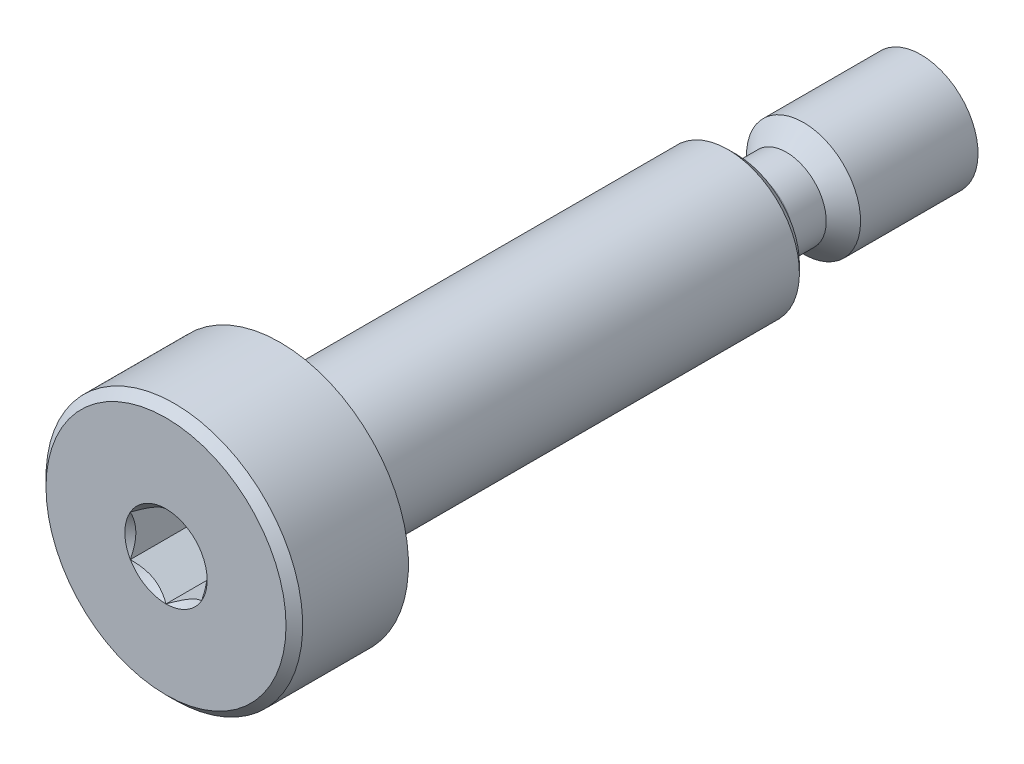
ISO-10303-21;
HEADER;
FILE_DESCRIPTION(('STEP AP214'),'2;1');
FILE_NAME('part.step','',(''),(''),'','','');
FILE_SCHEMA(('AUTOMOTIVE_DESIGN { 1 0 10303 214 1 1 1 1 }'));
ENDSEC;
DATA;
#1=APPLICATION_CONTEXT('core data for automotive mechanical design processes');
#2=APPLICATION_PROTOCOL_DEFINITION('international standard','automotive_design',2000,#1);
#3=PRODUCT_CONTEXT('',#1,'mechanical');
#4=PRODUCT('Part','Part','',(#3));
#5=PRODUCT_RELATED_PRODUCT_CATEGORY('part','',(#4));
#6=PRODUCT_DEFINITION_FORMATION('','',#4);
#7=PRODUCT_DEFINITION_CONTEXT('part definition',#1,'design');
#8=PRODUCT_DEFINITION('design','',#6,#7);
#9=PRODUCT_DEFINITION_SHAPE('','',#8);
#10=(LENGTH_UNIT() NAMED_UNIT(*) SI_UNIT(.MILLI.,.METRE.));
#11=(NAMED_UNIT(*) PLANE_ANGLE_UNIT() SI_UNIT($,.RADIAN.));
#12=(NAMED_UNIT(*) SI_UNIT($,.STERADIAN.) SOLID_ANGLE_UNIT());
#13=UNCERTAINTY_MEASURE_WITH_UNIT(LENGTH_MEASURE(1.E-05),#10,'distance_accuracy_value','');
#14=(GEOMETRIC_REPRESENTATION_CONTEXT(3) GLOBAL_UNCERTAINTY_ASSIGNED_CONTEXT((#13)) GLOBAL_UNIT_ASSIGNED_CONTEXT((#10,
#11,#12)) REPRESENTATION_CONTEXT('',''));
#15=CARTESIAN_POINT('',(0.,0.,0.));
#16=DIRECTION('',(0.,0.,1.));
#17=DIRECTION('',(1.,0.,0.));
#18=AXIS2_PLACEMENT_3D('',#15,#16,#17);
#19=CARTESIAN_POINT('',(0.,0.,-14.5));
#20=DIRECTION('',(0.,0.,-1.));
#21=DIRECTION('',(0.,1.,0.));
#22=AXIS2_PLACEMENT_3D('',#19,#20,#21);
#23=CYLINDRICAL_SURFACE('',#22,2.);
#24=CARTESIAN_POINT('',(0.,0.,-7.85200000000003));
#25=DIRECTION('',(0.,0.,-1.));
#26=DIRECTION('',(0.,1.,0.));
#27=AXIS2_PLACEMENT_3D('',#24,#25,#26);
#28=CIRCLE('',#27,2.);
#29=CARTESIAN_POINT('',(0.,1.99999999999999,-7.85200000000003));
#30=VERTEX_POINT('',#29);
#31=EDGE_CURVE('E72',#30,#30,#28,.F.);
#32=ORIENTED_EDGE('',*,*,#31,.F.);
#33=EDGE_LOOP('',(#32));
#34=FACE_BOUND('',#33,.T.);
#35=CARTESIAN_POINT('',(0.,0.,-11.97));
#36=DIRECTION('',(0.,0.,-1.));
#37=DIRECTION('',(0.,1.,0.));
#38=AXIS2_PLACEMENT_3D('',#35,#36,#37);
#39=CIRCLE('',#38,2.);
#40=CARTESIAN_POINT('',(0.,1.99999999999999,-11.97));
#41=VERTEX_POINT('',#40);
#42=EDGE_CURVE('E54',#41,#41,#39,.F.);
#43=ORIENTED_EDGE('',*,*,#42,.T.);
#44=EDGE_LOOP('',(#43));
#45=FACE_BOUND('',#44,.T.);
#46=ADVANCED_FACE('F50',(#34,#45),#23,.T.);
#47=CARTESIAN_POINT('',(0.,0.,-5.20750000000001));
#48=DIRECTION('',(0.,0.,1.));
#49=DIRECTION('',(1.,0.,0.));
#50=AXIS2_PLACEMENT_3D('',#47,#48,#49);
#51=PLANE('',#50);
#52=CARTESIAN_POINT('',(0.,0.,-5.20750000000001));
#53=DIRECTION('',(0.,0.,-1.));
#54=DIRECTION('',(0.,1.,0.));
#55=AXIS2_PLACEMENT_3D('',#52,#53,#54);
#56=CIRCLE('',#55,2.49999999999999);
#57=CARTESIAN_POINT('',(0.,2.49999999999999,-5.20750000000001));
#58=VERTEX_POINT('',#57);
#59=EDGE_CURVE('E66',#58,#58,#56,.F.);
#60=ORIENTED_EDGE('',*,*,#59,.T.);
#61=EDGE_LOOP('',(#60));
#62=FACE_BOUND('',#61,.T.);
#63=ADVANCED_FACE('F52',(#62),#51,.T.);
#64=CARTESIAN_POINT('',(0.,0.,-7.25000000000001));
#65=DIRECTION('',(0.,0.,-1.));
#66=DIRECTION('',(0.,1.,0.));
#67=AXIS2_PLACEMENT_3D('',#64,#65,#66);
#68=CONICAL_SURFACE('',#67,1.39799999999999,0.785398163397439);
#69=ORIENTED_EDGE('',*,*,#31,.T.);
#70=EDGE_LOOP('',(#69));
#71=FACE_BOUND('',#70,.T.);
#72=CARTESIAN_POINT('',(0.,0.,-7.25000000000001));
#73=DIRECTION('',(0.,0.,-1.));
#74=DIRECTION('',(0.,1.,0.));
#75=AXIS2_PLACEMENT_3D('',#72,#73,#74);
#76=CIRCLE('',#75,1.39799999999999);
#77=CARTESIAN_POINT('',(0.,1.39799999999998,-7.25000000000001));
#78=VERTEX_POINT('',#77);
#79=EDGE_CURVE('E12',#78,#78,#76,.T.);
#80=ORIENTED_EDGE('',*,*,#79,.T.);
#81=EDGE_LOOP('',(#80));
#82=FACE_BOUND('',#81,.T.);
#83=ADVANCED_FACE('F89',(#71,#82),#68,.T.);
#84=CARTESIAN_POINT('',(0.,0.,-14.5));
#85=DIRECTION('',(0.,0.,-1.));
#86=DIRECTION('',(0.,1.,0.));
#87=AXIS2_PLACEMENT_3D('',#84,#85,#86);
#88=CYLINDRICAL_SURFACE('',#87,1.39799999999998);
#89=ORIENTED_EDGE('',*,*,#79,.F.);
#90=EDGE_LOOP('',(#89));
#91=FACE_BOUND('',#90,.T.);
#92=CARTESIAN_POINT('',(0.,0.,-6.10200000000002));
#93=DIRECTION('',(0.,0.,-1.));
#94=DIRECTION('',(0.,1.,0.));
#95=AXIS2_PLACEMENT_3D('',#92,#93,#94);
#96=CIRCLE('',#95,1.39799999999998);
#97=CARTESIAN_POINT('',(0.,1.39799999999998,-6.10200000000002));
#98=VERTEX_POINT('',#97);
#99=EDGE_CURVE('E58',#98,#98,#96,.T.);
#100=ORIENTED_EDGE('',*,*,#99,.T.);
#101=EDGE_LOOP('',(#100));
#102=FACE_BOUND('',#101,.T.);
#103=ADVANCED_FACE('F99',(#91,#102),#88,.T.);
#104=CARTESIAN_POINT('',(0.,0.,-6.10200000000002));
#105=DIRECTION('',(0.,0.,-1.));
#106=DIRECTION('',(0.,1.,0.));
#107=AXIS2_PLACEMENT_3D('',#104,#105,#106);
#108=TOROIDAL_SURFACE('',#107,2.,0.602000000000012);
#109=ORIENTED_EDGE('',*,*,#99,.F.);
#110=EDGE_LOOP('',(#109));
#111=FACE_BOUND('',#110,.T.);
#112=CARTESIAN_POINT('',(0.,0.,-5.50000000000001));
#113=DIRECTION('',(0.,0.,-1.));
#114=DIRECTION('',(0.,1.,0.));
#115=AXIS2_PLACEMENT_3D('',#112,#113,#114);
#116=CIRCLE('',#115,2.);
#117=CARTESIAN_POINT('',(0.,1.99999999999999,-5.50000000000001));
#118=VERTEX_POINT('',#117);
#119=EDGE_CURVE('E63',#118,#118,#116,.T.);
#120=ORIENTED_EDGE('',*,*,#119,.T.);
#121=EDGE_LOOP('',(#120));
#122=FACE_BOUND('',#121,.T.);
#123=ADVANCED_FACE('F104',(#111,#122),#108,.F.);
#124=CARTESIAN_POINT('',(0.,-2.5,-5.50000000000001));
#125=DIRECTION('',(0.,0.,-1.));
#126=DIRECTION('',(0.,1.,0.));
#127=AXIS2_PLACEMENT_3D('',#124,#125,#126);
#128=PLANE('',#127);
#129=CARTESIAN_POINT('',(0.,0.,-5.50000000000001));
#130=DIRECTION('',(0.,0.,-1.));
#131=DIRECTION('',(0.,1.,0.));
#132=AXIS2_PLACEMENT_3D('',#129,#130,#131);
#133=CIRCLE('',#132,2.2075);
#134=CARTESIAN_POINT('',(0.,2.20749999999999,-5.50000000000001));
#135=VERTEX_POINT('',#134);
#136=EDGE_CURVE('E68',#135,#135,#133,.T.);
#137=ORIENTED_EDGE('',*,*,#136,.T.);
#138=EDGE_LOOP('',(#137));
#139=FACE_BOUND('',#138,.T.);
#140=ORIENTED_EDGE('',*,*,#119,.F.);
#141=EDGE_LOOP('',(#140));
#142=FACE_BOUND('',#141,.T.);
#143=ADVANCED_FACE('F85',(#139,#142),#128,.T.);
#144=CARTESIAN_POINT('',(0.,0.,-5.50000000000001));
#145=DIRECTION('',(0.,0.,1.));
#146=DIRECTION('',(0.,-1.,0.));
#147=AXIS2_PLACEMENT_3D('',#144,#145,#146);
#148=CONICAL_SURFACE('',#147,2.2075,0.785398163397445);
#149=ORIENTED_EDGE('',*,*,#59,.F.);
#150=EDGE_LOOP('',(#149));
#151=FACE_BOUND('',#150,.T.);
#152=ORIENTED_EDGE('',*,*,#136,.F.);
#153=EDGE_LOOP('',(#152));
#154=FACE_BOUND('',#153,.T.);
#155=ADVANCED_FACE('F80',(#151,#154),#148,.T.);
#156=CARTESIAN_POINT('',(0.,0.,-11.97));
#157=DIRECTION('',(0.,0.,-1.));
#158=DIRECTION('',(0.,1.,0.));
#159=AXIS2_PLACEMENT_3D('',#156,#157,#158);
#160=PLANE('',#159);
#161=ORIENTED_EDGE('',*,*,#42,.F.);
#162=EDGE_LOOP('',(#161));
#163=FACE_BOUND('',#162,.T.);
#164=ADVANCED_FACE('F78',(#163),#160,.T.);
#165=CLOSED_SHELL('',(#46,#63,#83,#103,#123,#143,#155,#164));
#166=MANIFOLD_SOLID_BREP('B2',#165);
#167=CARTESIAN_POINT('',(0.,0.,9.73749999999999));
#168=DIRECTION('',(0.,0.,1.));
#169=DIRECTION('',(1.,0.,0.));
#170=AXIS2_PLACEMENT_3D('',#167,#168,#169);
#171=PLANE('',#170);
#172=CARTESIAN_POINT('',(0.,0.,9.73749999999999));
#173=DIRECTION('',(0.,0.,-1.));
#174=DIRECTION('',(0.,1.,0.));
#175=AXIS2_PLACEMENT_3D('',#172,#173,#174);
#176=CIRCLE('',#175,2.49999999999999);
#177=CARTESIAN_POINT('',(0.,2.49999999999998,9.73749999999999));
#178=VERTEX_POINT('',#177);
#179=EDGE_CURVE('E178',#178,#178,#176,.T.);
#180=ORIENTED_EDGE('',*,*,#179,.T.);
#181=EDGE_LOOP('',(#180));
#182=FACE_BOUND('',#181,.T.);
#183=ADVANCED_FACE('F175',(#182),#171,.F.);
#184=CARTESIAN_POINT('',(0.,0.,-14.5));
#185=DIRECTION('',(0.,0.,-1.));
#186=DIRECTION('',(0.,1.,0.));
#187=AXIS2_PLACEMENT_3D('',#184,#185,#186);
#188=CYLINDRICAL_SURFACE('',#187,1.89999999999999);
#189=CARTESIAN_POINT('',(0.,0.,10.0625));
#190=DIRECTION('',(0.,0.,-1.));
#191=DIRECTION('',(0.,1.,0.));
#192=AXIS2_PLACEMENT_3D('',#189,#190,#191);
#193=CIRCLE('',#192,1.89999999999999);
#194=CARTESIAN_POINT('',(0.,1.89999999999998,10.0625));
#195=VERTEX_POINT('',#194);
#196=EDGE_CURVE('E442',#195,#195,#193,.F.);
#197=ORIENTED_EDGE('',*,*,#196,.T.);
#198=EDGE_LOOP('',(#197));
#199=FACE_BOUND('',#198,.T.);
#200=CARTESIAN_POINT('',(0.,0.,10.5));
#201=DIRECTION('',(0.,0.,-1.));
#202=DIRECTION('',(0.,1.,0.));
#203=AXIS2_PLACEMENT_3D('',#200,#201,#202);
#204=CIRCLE('',#203,1.89999999999999);
#205=CARTESIAN_POINT('',(0.,1.89999999999998,10.5));
#206=VERTEX_POINT('',#205);
#207=EDGE_CURVE('E253',#206,#206,#204,.T.);
#208=ORIENTED_EDGE('',*,*,#207,.T.);
#209=EDGE_LOOP('',(#208));
#210=FACE_BOUND('',#209,.T.);
#211=ADVANCED_FACE('F334',(#199,#210),#188,.T.);
#212=CARTESIAN_POINT('',(0.,2.49999999999998,9.90000000000001));
#213=DIRECTION('',(0.,0.,-1.));
#214=DIRECTION('',(0.,1.,0.));
#215=AXIS2_PLACEMENT_3D('',#212,#213,#214);
#216=PLANE('',#215);
#217=CARTESIAN_POINT('',(0.,0.,9.90000000000001));
#218=DIRECTION('',(0.,0.,-1.));
#219=DIRECTION('',(0.,1.,0.));
#220=AXIS2_PLACEMENT_3D('',#217,#218,#219);
#221=CIRCLE('',#220,2.33749999999998);
#222=CARTESIAN_POINT('',(0.,2.33749999999997,9.90000000000001));
#223=VERTEX_POINT('',#222);
#224=EDGE_CURVE('E437',#223,#223,#221,.F.);
#225=ORIENTED_EDGE('',*,*,#224,.T.);
#226=EDGE_LOOP('',(#225));
#227=FACE_BOUND('',#226,.T.);
#228=CARTESIAN_POINT('',(0.,0.,9.90000000000001));
#229=DIRECTION('',(0.,0.,-1.));
#230=DIRECTION('',(0.,1.,0.));
#231=AXIS2_PLACEMENT_3D('',#228,#229,#230);
#232=CIRCLE('',#231,2.0625);
#233=CARTESIAN_POINT('',(0.,2.06249999999999,9.90000000000001));
#234=VERTEX_POINT('',#233);
#235=EDGE_CURVE('E435',#234,#234,#232,.T.);
#236=ORIENTED_EDGE('',*,*,#235,.T.);
#237=EDGE_LOOP('',(#236));
#238=FACE_BOUND('',#237,.T.);
#239=ADVANCED_FACE('F339',(#227,#238),#216,.F.);
#240=CARTESIAN_POINT('',(0.,0.,14.5));
#241=DIRECTION('',(0.,0.,1.));
#242=DIRECTION('',(0.,-1.,0.));
#243=AXIS2_PLACEMENT_3D('',#240,#241,#242);
#244=PLANE('',#243);
#245=CARTESIAN_POINT('',(0.,0.,14.5));
#246=DIRECTION('',(0.,0.,1.));
#247=DIRECTION('',(1.,0.,0.));
#248=AXIS2_PLACEMENT_3D('',#245,#246,#247);
#249=CIRCLE('',#248,1.44337567297406);
#250=CARTESIAN_POINT('',(0.,-1.44337567297406,14.5));
#251=VERTEX_POINT('',#250);
#252=CARTESIAN_POINT('',(1.24999999999999,-0.721687836487042,14.5));
#253=VERTEX_POINT('',#252);
#254=EDGE_CURVE('E183',#251,#253,#249,.T.);
#255=ORIENTED_EDGE('',*,*,#254,.F.);
#256=CARTESIAN_POINT('',(-1.25,-0.721687836487036,14.5));
#257=VERTEX_POINT('',#256);
#258=EDGE_CURVE('E236',#257,#251,#249,.T.);
#259=ORIENTED_EDGE('',*,*,#258,.F.);
#260=CARTESIAN_POINT('',(-1.25,0.721687836487032,14.5));
#261=VERTEX_POINT('',#260);
#262=EDGE_CURVE('E265',#261,#257,#249,.T.);
#263=ORIENTED_EDGE('',*,*,#262,.F.);
#264=CARTESIAN_POINT('',(0.,1.44337567297406,14.5));
#265=VERTEX_POINT('',#264);
#266=EDGE_CURVE('E261',#265,#261,#249,.T.);
#267=ORIENTED_EDGE('',*,*,#266,.F.);
#268=CARTESIAN_POINT('',(1.25,0.721687836487033,14.5));
#269=VERTEX_POINT('',#268);
#270=EDGE_CURVE('E184',#269,#265,#249,.T.);
#271=ORIENTED_EDGE('',*,*,#270,.F.);
#272=EDGE_CURVE('E48',#253,#269,#249,.T.);
#273=ORIENTED_EDGE('',*,*,#272,.F.);
#274=EDGE_LOOP('',(#255,#259,#263,#267,#271,#273));
#275=FACE_BOUND('',#274,.T.);
#276=CARTESIAN_POINT('',(0.,0.,14.5));
#277=DIRECTION('',(0.,0.,1.));
#278=DIRECTION('',(0.,-1.,0.));
#279=AXIS2_PLACEMENT_3D('',#276,#277,#278);
#280=CIRCLE('',#279,4.20749999999998);
#281=CARTESIAN_POINT('',(0.,4.20749999999997,14.5));
#282=VERTEX_POINT('',#281);
#283=EDGE_CURVE('E447',#282,#282,#280,.T.);
#284=ORIENTED_EDGE('',*,*,#283,.T.);
#285=EDGE_LOOP('',(#284));
#286=FACE_BOUND('',#285,.T.);
#287=ADVANCED_FACE('F256',(#275,#286),#244,.T.);
#288=CARTESIAN_POINT('',(0.,0.,-14.5));
#289=DIRECTION('',(0.,0.,-1.));
#290=DIRECTION('',(0.,1.,0.));
#291=AXIS2_PLACEMENT_3D('',#288,#289,#290);
#292=CYLINDRICAL_SURFACE('',#291,4.49999999999999);
#293=CARTESIAN_POINT('',(0.,0.,14.2075));
#294=DIRECTION('',(0.,0.,1.));
#295=DIRECTION('',(0.,-1.,0.));
#296=AXIS2_PLACEMENT_3D('',#293,#294,#295);
#297=CIRCLE('',#296,4.49999999999999);
#298=CARTESIAN_POINT('',(0.,4.49999999999998,14.2075));
#299=VERTEX_POINT('',#298);
#300=EDGE_CURVE('E445',#299,#299,#297,.F.);
#301=ORIENTED_EDGE('',*,*,#300,.T.);
#302=EDGE_LOOP('',(#301));
#303=FACE_BOUND('',#302,.T.);
#304=CARTESIAN_POINT('',(0.,0.,10.5));
#305=DIRECTION('',(0.,0.,-1.));
#306=DIRECTION('',(0.,1.,0.));
#307=AXIS2_PLACEMENT_3D('',#304,#305,#306);
#308=CIRCLE('',#307,4.49999999999999);
#309=CARTESIAN_POINT('',(0.,4.49999999999998,10.5));
#310=VERTEX_POINT('',#309);
#311=EDGE_CURVE('E431',#310,#310,#308,.T.);
#312=ORIENTED_EDGE('',*,*,#311,.F.);
#313=EDGE_LOOP('',(#312));
#314=FACE_BOUND('',#313,.T.);
#315=ADVANCED_FACE('F420',(#303,#314),#292,.T.);
#316=CARTESIAN_POINT('',(0.,-4.5,10.5));
#317=DIRECTION('',(0.,0.,-1.));
#318=DIRECTION('',(0.,1.,0.));
#319=AXIS2_PLACEMENT_3D('',#316,#317,#318);
#320=PLANE('',#319);
#321=ORIENTED_EDGE('',*,*,#311,.T.);
#322=EDGE_LOOP('',(#321));
#323=FACE_BOUND('',#322,.T.);
#324=ORIENTED_EDGE('',*,*,#207,.F.);
#325=EDGE_LOOP('',(#324));
#326=FACE_BOUND('',#325,.T.);
#327=ADVANCED_FACE('F416',(#323,#326),#320,.T.);
#328=CARTESIAN_POINT('',(0.,0.,9.73749999999999));
#329=DIRECTION('',(0.,0.,-1.));
#330=DIRECTION('',(0.,1.,0.));
#331=AXIS2_PLACEMENT_3D('',#328,#329,#330);
#332=CONICAL_SURFACE('',#331,2.49999999999999,0.785398163397443);
#333=ORIENTED_EDGE('',*,*,#224,.F.);
#334=EDGE_LOOP('',(#333));
#335=FACE_BOUND('',#334,.T.);
#336=ORIENTED_EDGE('',*,*,#179,.F.);
#337=EDGE_LOOP('',(#336));
#338=FACE_BOUND('',#337,.T.);
#339=ADVANCED_FACE('F408',(#335,#338),#332,.T.);
#340=CARTESIAN_POINT('',(0.,0.,9.90000000000001));
#341=DIRECTION('',(0.,0.,-1.));
#342=DIRECTION('',(0.,1.,0.));
#343=AXIS2_PLACEMENT_3D('',#340,#341,#342);
#344=CONICAL_SURFACE('',#343,2.0625,0.785398163397466);
#345=ORIENTED_EDGE('',*,*,#196,.F.);
#346=EDGE_LOOP('',(#345));
#347=FACE_BOUND('',#346,.T.);
#348=ORIENTED_EDGE('',*,*,#235,.F.);
#349=EDGE_LOOP('',(#348));
#350=FACE_BOUND('',#349,.T.);
#351=ADVANCED_FACE('F402',(#347,#350),#344,.T.);
#352=CARTESIAN_POINT('',(0.,0.,14.2075));
#353=DIRECTION('',(0.,0.,-1.));
#354=DIRECTION('',(0.,1.,0.));
#355=AXIS2_PLACEMENT_3D('',#352,#353,#354);
#356=CONICAL_SURFACE('',#355,4.49999999999999,0.785398163397456);
#357=CARTESIAN_POINT('',(0.,4.20749999999997,14.5));
#358=CARTESIAN_POINT('',(0.,4.21054687499997,14.496953125));
#359=CARTESIAN_POINT('',(0.,4.21359374999997,14.49390625));
#360=CARTESIAN_POINT('',(0.,4.21968749999997,14.4878125));
#361=CARTESIAN_POINT('',(0.,4.22273437499997,14.484765625));
#362=CARTESIAN_POINT('',(0.,4.22882812499997,14.478671875));
#363=CARTESIAN_POINT('',(0.,4.23187499999998,14.475625));
#364=CARTESIAN_POINT('',(0.,4.23796874999998,14.46953125));
#365=CARTESIAN_POINT('',(0.,4.24101562499998,14.466484375));
#366=CARTESIAN_POINT('',(0.,4.24710937499998,14.460390625));
#367=CARTESIAN_POINT('',(0.,4.25015624999997,14.45734375));
#368=CARTESIAN_POINT('',(0.,4.25624999999998,14.45125));
#369=CARTESIAN_POINT('',(0.,4.25929687499998,14.448203125));
#370=CARTESIAN_POINT('',(0.,4.26539062499998,14.442109375));
#371=CARTESIAN_POINT('',(0.,4.26843749999998,14.4390625));
#372=CARTESIAN_POINT('',(0.,4.27453124999998,14.43296875));
#373=CARTESIAN_POINT('',(0.,4.27757812499998,14.429921875));
#374=CARTESIAN_POINT('',(0.,4.28367187499998,14.423828125));
#375=CARTESIAN_POINT('',(0.,4.28671874999998,14.42078125));
#376=CARTESIAN_POINT('',(0.,4.29281249999998,14.4146875));
#377=CARTESIAN_POINT('',(0.,4.29585937499998,14.411640625));
#378=CARTESIAN_POINT('',(0.,4.30195312499998,14.405546875));
#379=CARTESIAN_POINT('',(0.,4.30499999999998,14.4025));
#380=CARTESIAN_POINT('',(0.,4.31109374999998,14.39640625));
#381=CARTESIAN_POINT('',(0.,4.31414062499998,14.393359375));
#382=CARTESIAN_POINT('',(0.,4.32023437499998,14.387265625));
#383=CARTESIAN_POINT('',(0.,4.32328124999998,14.38421875));
#384=CARTESIAN_POINT('',(0.,4.32937499999998,14.378125));
#385=CARTESIAN_POINT('',(0.,4.33242187499998,14.375078125));
#386=CARTESIAN_POINT('',(0.,4.33851562499998,14.368984375));
#387=CARTESIAN_POINT('',(0.,4.34156249999998,14.3659375));
#388=CARTESIAN_POINT('',(0.,4.34765624999998,14.35984375));
#389=CARTESIAN_POINT('',(0.,4.35070312499998,14.356796875));
#390=CARTESIAN_POINT('',(0.,4.35679687499998,14.350703125));
#391=CARTESIAN_POINT('',(0.,4.35984374999998,14.34765625));
#392=CARTESIAN_POINT('',(0.,4.36593749999998,14.3415625));
#393=CARTESIAN_POINT('',(0.,4.36898437499998,14.338515625));
#394=CARTESIAN_POINT('',(0.,4.37507812499998,14.332421875));
#395=CARTESIAN_POINT('',(0.,4.37812499999998,14.329375));
#396=CARTESIAN_POINT('',(0.,4.38421874999998,14.32328125));
#397=CARTESIAN_POINT('',(0.,4.38726562499998,14.320234375));
#398=CARTESIAN_POINT('',(0.,4.39335937499998,14.314140625));
#399=CARTESIAN_POINT('',(0.,4.39640624999998,14.31109375));
#400=CARTESIAN_POINT('',(0.,4.40249999999998,14.305));
#401=CARTESIAN_POINT('',(0.,4.40554687499998,14.301953125));
#402=CARTESIAN_POINT('',(0.,4.41164062499998,14.295859375));
#403=CARTESIAN_POINT('',(0.,4.41468749999998,14.2928125));
#404=CARTESIAN_POINT('',(0.,4.42078124999998,14.28671875));
#405=CARTESIAN_POINT('',(0.,4.42382812499998,14.283671875));
#406=CARTESIAN_POINT('',(0.,4.42992187499998,14.277578125));
#407=CARTESIAN_POINT('',(0.,4.43296874999998,14.27453125));
#408=CARTESIAN_POINT('',(0.,4.43906249999998,14.2684375));
#409=CARTESIAN_POINT('',(0.,4.44210937499998,14.265390625));
#410=CARTESIAN_POINT('',(0.,4.44820312499998,14.259296875));
#411=CARTESIAN_POINT('',(0.,4.45124999999998,14.25625));
#412=CARTESIAN_POINT('',(0.,4.45734374999998,14.25015625));
#413=CARTESIAN_POINT('',(0.,4.46039062499998,14.247109375));
#414=CARTESIAN_POINT('',(0.,4.46648437499998,14.241015625));
#415=CARTESIAN_POINT('',(0.,4.46953124999998,14.23796875));
#416=CARTESIAN_POINT('',(0.,4.47562499999998,14.231875));
#417=CARTESIAN_POINT('',(0.,4.47867187499998,14.228828125));
#418=CARTESIAN_POINT('',(0.,4.48476562499998,14.222734375));
#419=CARTESIAN_POINT('',(0.,4.48781249999998,14.2196875));
#420=CARTESIAN_POINT('',(0.,4.49390624999998,14.21359375));
#421=CARTESIAN_POINT('',(0.,4.49695312499998,14.210546875));
#422=CARTESIAN_POINT('',(0.,4.49999999999998,14.2075));
#423=B_SPLINE_CURVE_WITH_KNOTS('',3,(#357,#358,#359,#360,#361,#362,#363,#364,#365,#366,#367,
#368,#369,#370,#371,#372,#373,#374,#375,#376,#377,#378,#379,#380,#381,#382,#383,#384,#385,#386,
#387,#388,#389,#390,#391,#392,#393,#394,#395,#396,#397,#398,#399,#400,#401,#402,#403,#404,#405,
#406,#407,#408,#409,#410,#411,#412,#413,#414,#415,#416,#417,#418,#419,#420,#421,#422),
.UNSPECIFIED.,.F.,.F.,(4,2,2,2,2,2,2,2,2,2,2,2,2,2,2,2,2,2,2,2,2,2,2,2,2,2,2,2,2,2,2,2,4),(0.,
0.0129267958435672,0.0258535916871345,0.0387803875307011,0.0517071833742683,0.0646339792178343,
0.0775607750614022,0.0904875709049682,0.103414366748535,0.116341162592103,0.129267958435669,
0.142194754279236,0.155121550122802,0.16804834596637,0.180975141809936,0.193901937653504,
0.20682873349707,0.219755529340637,0.232682325184205,0.245609121027771,0.258535916871338,
0.271462712714904,0.284389508558472,0.297316304402038,0.310243100245606,0.323169896089173,
0.336096691932739,0.349023487776307,0.361950283619873,0.37487707946344,0.387803875307006,
0.400730671150574,0.413657466994141),.UNSPECIFIED.);
#424=EDGE_CURVE('BSEAM398',#282,#299,#423,.T.);
#425=ORIENTED_EDGE('',*,*,#283,.F.);
#426=ORIENTED_EDGE('',*,*,#300,.F.);
#427=ORIENTED_EDGE('',*,*,#424,.T.);
#428=ORIENTED_EDGE('',*,*,#424,.F.);
#429=EDGE_LOOP('',(#425,#427,#426,#428));
#430=FACE_BOUND('',#429,.T.);
#431=ADVANCED_FACE('F398',(#430),#356,.T.);
#432=CARTESIAN_POINT('',(0.,0.,14.5));
#433=DIRECTION('',(0.,0.,1.));
#434=DIRECTION('',(1.,0.,0.));
#435=AXIS2_PLACEMENT_3D('',#432,#433,#434);
#436=CONICAL_SURFACE('',#435,1.44337567297406,0.78539816339745);
#437=ORIENTED_EDGE('',*,*,#270,.T.);
#438=CARTESIAN_POINT('',(1.2502,0.721572366433192,14.5001154839091));
#439=CARTESIAN_POINT('',(1.20722483292841,0.746384090710441,14.4753216680551));
#440=CARTESIAN_POINT('',(1.16353099525405,0.771610739653662,14.4519837344187));
#441=CARTESIAN_POINT('',(1.07443406915806,0.823050873919152,14.4092520040845));
#442=CARTESIAN_POINT('',(1.02902250164294,0.849269254648331,14.3898819923604));
#443=CARTESIAN_POINT('',(0.937452179064741,0.902137405038632,14.3567004834135));
#444=CARTESIAN_POINT('',(0.891316759824115,0.928773701756384,14.3428055590527));
#445=CARTESIAN_POINT('',(0.798029919592408,0.982632884076009,14.3213972821606));
#446=CARTESIAN_POINT('',(0.750881350863621,1.00985412292348,14.3138679415668));
#447=CARTESIAN_POINT('',(0.669626443112749,1.05676666578642,14.3070744980507));
#448=CARTESIAN_POINT('',(0.63562512337206,1.07639733689151,14.3060685591044));
#449=CARTESIAN_POINT('',(0.567682235567524,1.11562418145498,14.3077614149113));
#450=CARTESIAN_POINT('',(0.533740682344344,1.1352203463451,14.3104610272155));
#451=CARTESIAN_POINT('',(0.466185143542502,1.17422355485759,14.3194089303164));
#452=CARTESIAN_POINT('',(0.432571492713227,1.19363040521232,14.3256605258997));
#453=CARTESIAN_POINT('',(0.365905361782188,1.23212011385119,14.3413756814139));
#454=CARTESIAN_POINT('',(0.332853128969706,1.25120282936279,14.3508406200875));
#455=CARTESIAN_POINT('',(0.248200308399737,1.30007715810653,14.3789313906876));
#456=CARTESIAN_POINT('',(0.197133507570363,1.32956058931202,14.3996701574522));
#457=CARTESIAN_POINT('',(0.0969991458867464,1.38737318998518,14.4463871346715));
#458=CARTESIAN_POINT('',(0.0479256884217317,1.41570576386268,14.4723482959468));
#459=CARTESIAN_POINT('',(-0.000199999999999111,1.4434911430279,14.5001154839091));
#460=B_SPLINE_CURVE_WITH_KNOTS('',3,(#438,#439,#440,#441,#442,#443,#444,#445,#446,#447,#448,
#449,#450,#451,#452,#453,#454,#455,#456,#457,#458,#459),.UNSPECIFIED.,.F.,.F.,(4,2,2,2,2,2,2,2,
2,2,4),(0.,0.166533409618304,0.334037607289761,0.498880396489697,0.663307919240273,
0.780963963458826,0.898645970148451,1.01643764860773,1.13427993171549,1.32148652032141,
1.50809158792573),.UNSPECIFIED.);
#461=EDGE_CURVE('E293',#269,#265,#460,.T.);
#462=ORIENTED_EDGE('',*,*,#461,.F.);
#463=EDGE_LOOP('',(#437,#462));
#464=FACE_BOUND('',#463,.T.);
#465=ADVANCED_FACE('F288',(#464),#436,.F.);
#466=ORIENTED_EDGE('',*,*,#266,.T.);
#467=CARTESIAN_POINT('',(0.000200000000000473,1.4434911430279,14.5001154839091));
#468=CARTESIAN_POINT('',(-0.0427751670715865,1.41867941875065,14.4753216680551));
#469=CARTESIAN_POINT('',(-0.0864690047459476,1.39345276980743,14.4519837344187));
#470=CARTESIAN_POINT('',(-0.175565930841941,1.34201263554194,14.4092520040845));
#471=CARTESIAN_POINT('',(-0.220977498357063,1.31579425481276,14.3898819923604));
#472=CARTESIAN_POINT('',(-0.312547820935258,1.26292610442246,14.3567004834135));
#473=CARTESIAN_POINT('',(-0.358683240175884,1.23628980770471,14.3428055590527));
#474=CARTESIAN_POINT('',(-0.451970080407591,1.18243062538508,14.3213972821606));
#475=CARTESIAN_POINT('',(-0.499118649136378,1.15520938653761,14.3138679415668));
#476=CARTESIAN_POINT('',(-0.580373556887251,1.10829684367467,14.3070744980507));
#477=CARTESIAN_POINT('',(-0.614374876627939,1.08866617256958,14.3060685591044));
#478=CARTESIAN_POINT('',(-0.682317764432476,1.04943932800611,14.3077614149113));
#479=CARTESIAN_POINT('',(-0.716259317655656,1.02984316311599,14.3104610272155));
#480=CARTESIAN_POINT('',(-0.783814856457498,0.990839954603497,14.3194089303164));
#481=CARTESIAN_POINT('',(-0.817428507286773,0.971433104248769,14.3256605258997));
#482=CARTESIAN_POINT('',(-0.884094638217812,0.932943395609903,14.3413756814139));
#483=CARTESIAN_POINT('',(-0.917146871030294,0.913860680098298,14.3508406200875));
#484=CARTESIAN_POINT('',(-1.00179969160026,0.864986351354566,14.3789313906876));
#485=CARTESIAN_POINT('',(-1.05286649242964,0.835502920149073,14.3996701574522));
#486=CARTESIAN_POINT('',(-1.15300085411325,0.777690319475906,14.4463871346715));
#487=CARTESIAN_POINT('',(-1.20207431157827,0.749357745598414,14.4723482959468));
#488=CARTESIAN_POINT('',(-1.2502,0.721572366433192,14.5001154839091));
#489=B_SPLINE_CURVE_WITH_KNOTS('',3,(#467,#468,#469,#470,#471,#472,#473,#474,#475,#476,#477,
#478,#479,#480,#481,#482,#483,#484,#485,#486,#487,#488),.UNSPECIFIED.,.F.,.F.,(4,2,2,2,2,2,2,2,
2,2,4),(0.,0.166533409618303,0.33403760728976,0.498880396489696,0.663307919240273,
0.780963963458825,0.898645970148451,1.01643764860773,1.13427993171549,1.32148652032141,
1.50809158792573),.UNSPECIFIED.);
#490=EDGE_CURVE('E264',#265,#261,#489,.T.);
#491=ORIENTED_EDGE('',*,*,#490,.F.);
#492=EDGE_LOOP('',(#466,#491));
#493=FACE_BOUND('',#492,.T.);
#494=ADVANCED_FACE('F391',(#493),#436,.F.);
#495=ORIENTED_EDGE('',*,*,#262,.T.);
#496=CARTESIAN_POINT('',(-1.25,-1.43934010808077,14.9629820968923));
#497=CARTESIAN_POINT('',(-1.25,-1.40429313005659,14.9365249226329));
#498=CARTESIAN_POINT('',(-1.25,-1.36905087135599,14.9103271603543));
#499=CARTESIAN_POINT('',(-1.25,-1.29809650706311,14.8585575718396));
#500=CARTESIAN_POINT('',(-1.25,-1.26238428576496,14.8329859043563));
#501=CARTESIAN_POINT('',(-1.25,-1.15390111792708,14.7570059936895));
#502=CARTESIAN_POINT('',(-1.25,-1.08031646726265,14.7077402861896));
#503=CARTESIAN_POINT('',(-1.25,-0.926012322755098,14.6110258302631));
#504=CARTESIAN_POINT('',(-1.25,-0.845125318656149,14.5638412989418));
#505=CARTESIAN_POINT('',(-1.25,-0.679311174076604,14.4775307343904));
#506=CARTESIAN_POINT('',(-1.25,-0.59439889102669,14.4383775346269));
#507=CARTESIAN_POINT('',(-1.25,-0.466944812460743,14.3904772236883));
#508=CARTESIAN_POINT('',(-1.25,-0.426289985812824,14.3767294897863));
#509=CARTESIAN_POINT('',(-1.25,-0.34399885009127,14.3524979274505));
#510=CARTESIAN_POINT('',(-1.25,-0.302362473614965,14.3420143238698));
#511=CARTESIAN_POINT('',(-1.25,-0.219052696285668,14.3250301617483));
#512=CARTESIAN_POINT('',(-1.25,-0.177393428474502,14.3184613604714));
#513=CARTESIAN_POINT('',(-1.25,-0.0936293693401945,14.3094350534578));
#514=CARTESIAN_POINT('',(-1.25,-0.0515246558543984,14.3069768409973));
#515=CARTESIAN_POINT('',(-1.25,0.0311890576306293,14.3063540620133));
#516=CARTESIAN_POINT('',(-1.25,0.0717969625499282,14.3080371168462));
#517=CARTESIAN_POINT('',(-1.25,0.152668636885195,14.3152682705979));
#518=CARTESIAN_POINT('',(-1.25,0.192932338835356,14.3208171104131));
#519=CARTESIAN_POINT('',(-1.25,0.273499879165293,14.335571036465));
#520=CARTESIAN_POINT('',(-1.25,0.313792180618508,14.3448381759641));
#521=CARTESIAN_POINT('',(-1.25,0.393496413911455,14.3665361784573));
#522=CARTESIAN_POINT('',(-1.25,0.432908419115057,14.3789667767306));
#523=CARTESIAN_POINT('',(-1.25,0.556992735862296,14.4227793529314));
#524=CARTESIAN_POINT('',(-1.25,0.639898924666082,14.459151072876));
#525=CARTESIAN_POINT('',(-1.25,0.801816555499698,14.5400191621783));
#526=CARTESIAN_POINT('',(-1.25,0.880812666325041,14.584544720912));
#527=CARTESIAN_POINT('',(-1.25,1.0317856127975,14.6764048766666));
#528=CARTESIAN_POINT('',(-1.25,1.10391618485085,14.7234899339162));
#529=CARTESIAN_POINT('',(-1.25,1.2101860604331,14.7962785615985));
#530=CARTESIAN_POINT('',(-1.25,1.24515069969379,14.8207980853934));
#531=CARTESIAN_POINT('',(-1.25,1.31460220852736,14.8704856367657));
#532=CARTESIAN_POINT('',(-1.25,1.34908920596618,14.8956534854155));
#533=CARTESIAN_POINT('',(-1.25,1.38337731682911,14.9210901488412));
#534=B_SPLINE_CURVE_WITH_KNOTS('',3,(#496,#497,#498,#499,#500,#501,#502,#503,#504,#505,#506,
#507,#508,#509,#510,#511,#512,#513,#514,#515,#516,#517,#518,#519,#520,#521,#522,#523,#524,#525,
#526,#527,#528,#529,#530,#531,#532,#533),.UNSPECIFIED.,.F.,.F.,(4,2,2,2,2,2,2,2,2,2,2,2,2,2,2,2,
2,2,4),(0.,0.131732960381448,0.263498984161645,0.529042014455826,0.809741926134619,
1.08947609717225,1.21811634272577,1.346765447839,1.47310084517844,1.59941451973785,
1.72115042167849,1.84290966131735,1.96679153905342,2.09066305366039,2.36146692896009,
2.63325989198491,2.89154668212279,3.01965734507712,3.14773302245628),.UNSPECIFIED.);
#535=EDGE_CURVE('E267',#261,#257,#534,.F.);
#536=ORIENTED_EDGE('',*,*,#535,.F.);
#537=EDGE_LOOP('',(#495,#536));
#538=FACE_BOUND('',#537,.T.);
#539=ADVANCED_FACE('F388',(#538),#436,.F.);
#540=ORIENTED_EDGE('',*,*,#258,.T.);
#541=CARTESIAN_POINT('',(-1.2502,-0.721572366433198,14.5001154839091));
#542=CARTESIAN_POINT('',(-1.20722483292841,-0.746384090710448,14.4753216680551));
#543=CARTESIAN_POINT('',(-1.16353099525405,-0.771610739653668,14.4519837344187));
#544=CARTESIAN_POINT('',(-1.07443406915806,-0.823050873919158,14.4092520040845));
#545=CARTESIAN_POINT('',(-1.02902250164294,-0.849269254648337,14.3898819923604));
#546=CARTESIAN_POINT('',(-0.937452179064741,-0.902137405038639,14.3567004834135));
#547=CARTESIAN_POINT('',(-0.891316759824116,-0.92877370175639,14.3428055590527));
#548=CARTESIAN_POINT('',(-0.798029919592409,-0.982632884076016,14.3213972821606));
#549=CARTESIAN_POINT('',(-0.750881350863622,-1.00985412292349,14.3138679415668));
#550=CARTESIAN_POINT('',(-0.66962644311275,-1.05676666578643,14.3070744980507));
#551=CARTESIAN_POINT('',(-0.635625123372061,-1.07639733689152,14.3060685591044));
#552=CARTESIAN_POINT('',(-0.567682235567525,-1.11562418145499,14.3077614149113));
#553=CARTESIAN_POINT('',(-0.533740682344345,-1.13522034634511,14.3104610272155));
#554=CARTESIAN_POINT('',(-0.466185143542503,-1.1742235548576,14.3194089303164));
#555=CARTESIAN_POINT('',(-0.432571492713228,-1.19363040521233,14.3256605258997));
#556=CARTESIAN_POINT('',(-0.365905361782189,-1.23212011385119,14.3413756814139));
#557=CARTESIAN_POINT('',(-0.332853128969707,-1.2512028293628,14.3508406200875));
#558=CARTESIAN_POINT('',(-0.248200308399738,-1.30007715810653,14.3789313906876));
#559=CARTESIAN_POINT('',(-0.197133507570364,-1.32956058931203,14.3996701574522));
#560=CARTESIAN_POINT('',(-0.0969991458867465,-1.38737318998519,14.4463871346715));
#561=CARTESIAN_POINT('',(-0.0479256884217316,-1.41570576386268,14.4723482959468));
#562=CARTESIAN_POINT('',(0.000199999999999117,-1.44349114302791,14.5001154839091));
#563=B_SPLINE_CURVE_WITH_KNOTS('',3,(#541,#542,#543,#544,#545,#546,#547,#548,#549,#550,#551,
#552,#553,#554,#555,#556,#557,#558,#559,#560,#561,#562),.UNSPECIFIED.,.F.,.F.,(4,2,2,2,2,2,2,2,
2,2,4),(0.,0.166533409618303,0.33403760728976,0.498880396489694,0.66330791924027,
0.780963963458822,0.898645970148449,1.01643764860773,1.13427993171549,1.32148652032141,
1.50809158792573),.UNSPECIFIED.);
#564=EDGE_CURVE('E248',#257,#251,#563,.T.);
#565=ORIENTED_EDGE('',*,*,#564,.F.);
#566=EDGE_LOOP('',(#540,#565));
#567=FACE_BOUND('',#566,.T.);
#568=ADVANCED_FACE('F397',(#567),#436,.F.);
#569=ORIENTED_EDGE('',*,*,#254,.T.);
#570=CARTESIAN_POINT('',(-0.000200000000000874,-1.44349114302791,14.5001154839091));
#571=CARTESIAN_POINT('',(0.0427751670715863,-1.41867941875066,14.4753216680551));
#572=CARTESIAN_POINT('',(0.0864690047459478,-1.39345276980744,14.4519837344187));
#573=CARTESIAN_POINT('',(0.175565930841942,-1.34201263554195,14.4092520040845));
#574=CARTESIAN_POINT('',(0.220977498357064,-1.31579425481277,14.3898819923604));
#575=CARTESIAN_POINT('',(0.31254782093526,-1.26292610442247,14.3567004834135));
#576=CARTESIAN_POINT('',(0.358683240175886,-1.23628980770471,14.3428055590527));
#577=CARTESIAN_POINT('',(0.451970080407593,-1.18243062538509,14.3213972821606));
#578=CARTESIAN_POINT('',(0.49911864913638,-1.15520938653762,14.3138679415668));
#579=CARTESIAN_POINT('',(0.580373556887252,-1.10829684367467,14.3070744980507));
#580=CARTESIAN_POINT('',(0.614374876627941,-1.08866617256958,14.3060685591044));
#581=CARTESIAN_POINT('',(0.682317764432477,-1.04943932800611,14.3077614149113));
#582=CARTESIAN_POINT('',(0.716259317655657,-1.029843163116,14.3104610272155));
#583=CARTESIAN_POINT('',(0.7838148564575,-0.990839954603504,14.3194089303164));
#584=CARTESIAN_POINT('',(0.817428507286775,-0.971433104248776,14.3256605258997));
#585=CARTESIAN_POINT('',(0.884094638217814,-0.93294339560991,14.3413756814139));
#586=CARTESIAN_POINT('',(0.917146871030296,-0.913860680098305,14.3508406200875));
#587=CARTESIAN_POINT('',(1.00179969160026,-0.864986351354573,14.3789313906876));
#588=CARTESIAN_POINT('',(1.05286649242964,-0.835502920149081,14.3996701574522));
#589=CARTESIAN_POINT('',(1.15300085411325,-0.777690319475913,14.4463871346715));
#590=CARTESIAN_POINT('',(1.20207431157827,-0.749357745598421,14.4723482959468));
#591=CARTESIAN_POINT('',(1.2502,-0.721572366433199,14.5001154839091));
#592=B_SPLINE_CURVE_WITH_KNOTS('',3,(#570,#571,#572,#573,#574,#575,#576,#577,#578,#579,#580,
#581,#582,#583,#584,#585,#586,#587,#588,#589,#590,#591),.UNSPECIFIED.,.F.,.F.,(4,2,2,2,2,2,2,2,
2,2,4),(0.,0.166533409618304,0.334037607289763,0.4988803964897,0.663307919240275,
0.780963963458827,0.898645970148454,1.01643764860773,1.1342799317155,1.32148652032141,
1.50809158792574),.UNSPECIFIED.);
#593=EDGE_CURVE('E232',#251,#253,#592,.T.);
#594=ORIENTED_EDGE('',*,*,#593,.F.);
#595=EDGE_LOOP('',(#569,#594));
#596=FACE_BOUND('',#595,.T.);
#597=ADVANCED_FACE('F230',(#596),#436,.F.);
#598=ORIENTED_EDGE('',*,*,#272,.T.);
#599=CARTESIAN_POINT('',(1.25,-1.43934010829019,14.9629820970504));
#600=CARTESIAN_POINT('',(1.25,-1.40429313026013,14.9365249227849));
#601=CARTESIAN_POINT('',(1.25,-1.36905087155364,14.9103271605002));
#602=CARTESIAN_POINT('',(1.25,-1.29809650724891,14.8585575719734));
#603=CARTESIAN_POINT('',(1.25,-1.2623842859448,14.8329859044841));
#604=CARTESIAN_POINT('',(1.25,-1.15390111808871,14.757005993799));
#605=CARTESIAN_POINT('',(1.25,-1.08031646741188,14.707740286287));
#606=CARTESIAN_POINT('',(1.25,-0.926012322877305,14.6110258303356));
#607=CARTESIAN_POINT('',(1.25,-0.845125318763651,14.5638412990016));
#608=CARTESIAN_POINT('',(1.25,-0.679311174153447,14.4775307344266));
#609=CARTESIAN_POINT('',(1.25,-0.594398891087587,14.4383775346522));
#610=CARTESIAN_POINT('',(1.25,-0.466944812509642,14.3904772237056));
#611=CARTESIAN_POINT('',(1.25,-0.426289985866747,14.3767294898039));
#612=CARTESIAN_POINT('',(1.25,-0.343998850155405,14.3524979274677));
#613=CARTESIAN_POINT('',(1.25,-0.302362473684288,14.3420143238863));
#614=CARTESIAN_POINT('',(1.25,-0.219052696365197,14.3250301617622));
#615=CARTESIAN_POINT('',(1.25,-0.177393428559046,14.3184613604834));
#616=CARTESIAN_POINT('',(1.25,-0.0936293694345997,14.309435053465));
#617=CARTESIAN_POINT('',(1.25,-0.0515246559536503,14.3069768410015));
#618=CARTESIAN_POINT('',(1.25,0.0311890575224376,14.3063540620107));
#619=CARTESIAN_POINT('',(1.25,0.0717969624376308,14.3080371168399));
#620=CARTESIAN_POINT('',(1.25,0.152668636765092,14.3152682705835));
#621=CARTESIAN_POINT('',(1.25,0.192932338711552,14.3208171103943));
#622=CARTESIAN_POINT('',(1.25,0.273499879034188,14.335571036437));
#623=CARTESIAN_POINT('',(1.25,0.313792180483813,14.3448381759314));
#624=CARTESIAN_POINT('',(1.25,0.393496413769924,14.3665361784149));
#625=CARTESIAN_POINT('',(1.25,0.432908418970282,14.3789667766833));
#626=CARTESIAN_POINT('',(1.25,0.556992735685996,14.4227793528609));
#627=CARTESIAN_POINT('',(1.25,0.639898924463082,14.4591510727842));
#628=CARTESIAN_POINT('',(1.25,0.801816555245346,14.5400191620416));
#629=CARTESIAN_POINT('',(1.25,0.880812666046052,14.5845447207516));
#630=CARTESIAN_POINT('',(1.25,1.03178561247421,14.676404876461));
#631=CARTESIAN_POINT('',(1.25,1.10391618450775,14.7234899336892));
#632=CARTESIAN_POINT('',(1.25,1.2101860600607,14.7962785613395));
#633=CARTESIAN_POINT('',(1.25,1.24515069931176,14.8207980851238));
#634=CARTESIAN_POINT('',(1.25,1.31460220812614,14.8704856364749));
#635=CARTESIAN_POINT('',(1.25,1.34908920555539,14.8956534851142));
#636=CARTESIAN_POINT('',(1.25,1.38337731640878,14.9210901485293));
#637=B_SPLINE_CURVE_WITH_KNOTS('',3,(#599,#600,#601,#602,#603,#604,#605,#606,#607,#608,#609,
#610,#611,#612,#613,#614,#615,#616,#617,#618,#619,#620,#621,#622,#623,#624,#625,#626,#627,#628,
#629,#630,#631,#632,#633,#634,#635,#636),.UNSPECIFIED.,.F.,.F.,(4,2,2,2,2,2,2,2,2,2,2,2,2,2,2,2,
2,2,4),(0.,0.131732960406522,0.263498984211802,0.529042014557081,0.809741926293179,
1.08947609738757,1.21811634292656,1.3467654480253,1.47310084535082,1.59941451989631,
1.72115042182424,1.84290966145034,1.96679153917269,2.09066305376595,2.36146692896708,
2.63325989189267,2.89154668194565,3.01965734485811,3.1477330221954),.UNSPECIFIED.);
#638=EDGE_CURVE('E237',#253,#269,#637,.T.);
#639=ORIENTED_EDGE('',*,*,#638,.F.);
#640=EDGE_LOOP('',(#598,#639));
#641=FACE_BOUND('',#640,.T.);
#642=ADVANCED_FACE('F238',(#641),#436,.F.);
#643=CARTESIAN_POINT('',(0.,0.,12.5));
#644=DIRECTION('',(0.,0.,1.));
#645=DIRECTION('',(1.,0.,0.));
#646=AXIS2_PLACEMENT_3D('',#643,#644,#645);
#647=PLANE('',#646);
#648=DIRECTION('',(0.,1.,0.));
#649=VECTOR('',#648,1.);
#650=CARTESIAN_POINT('',(1.25,-0.721687836487037,12.5));
#651=LINE('',#650,#649);
#652=CARTESIAN_POINT('',(1.25,-0.721687836487037,12.5));
#653=VERTEX_POINT('',#652);
#654=CARTESIAN_POINT('',(1.25,0.72168783648703,12.5));
#655=VERTEX_POINT('',#654);
#656=EDGE_CURVE('E240',#653,#655,#651,.T.);
#657=ORIENTED_EDGE('',*,*,#656,.T.);
#658=DIRECTION('',(-0.866025403784439,0.5,0.));
#659=VECTOR('',#658,1.);
#660=CARTESIAN_POINT('',(1.25,0.72168783648703,12.5));
#661=LINE('',#660,#659);
#662=CARTESIAN_POINT('',(0.,1.44337567297406,12.5));
#663=VERTEX_POINT('',#662);
#664=EDGE_CURVE('E357',#655,#663,#661,.T.);
#665=ORIENTED_EDGE('',*,*,#664,.T.);
#666=DIRECTION('',(-0.866025403784439,-0.5,0.));
#667=VECTOR('',#666,1.);
#668=CARTESIAN_POINT('',(0.,1.44337567297406,12.5));
#669=LINE('',#668,#667);
#670=CARTESIAN_POINT('',(-1.25,0.72168783648703,12.5));
#671=VERTEX_POINT('',#670);
#672=EDGE_CURVE('E377',#663,#671,#669,.T.);
#673=ORIENTED_EDGE('',*,*,#672,.T.);
#674=DIRECTION('',(0.,-1.,0.));
#675=VECTOR('',#674,1.);
#676=CARTESIAN_POINT('',(-1.25,0.72168783648703,12.5));
#677=LINE('',#676,#675);
#678=CARTESIAN_POINT('',(-1.25,-0.721687836487036,12.5));
#679=VERTEX_POINT('',#678);
#680=EDGE_CURVE('E374',#671,#679,#677,.T.);
#681=ORIENTED_EDGE('',*,*,#680,.T.);
#682=DIRECTION('',(0.866025403784438,-0.500000000000001,0.));
#683=VECTOR('',#682,1.);
#684=CARTESIAN_POINT('',(-1.25,-0.721687836487036,12.5));
#685=LINE('',#684,#683);
#686=CARTESIAN_POINT('',(0.,-1.44337567297407,12.5));
#687=VERTEX_POINT('',#686);
#688=EDGE_CURVE('E361',#679,#687,#685,.T.);
#689=ORIENTED_EDGE('',*,*,#688,.T.);
#690=DIRECTION('',(0.866025403784439,0.5,0.));
#691=VECTOR('',#690,1.);
#692=CARTESIAN_POINT('',(0.,-1.44337567297407,12.5));
#693=LINE('',#692,#691);
#694=EDGE_CURVE('E358',#687,#653,#693,.T.);
#695=ORIENTED_EDGE('',*,*,#694,.T.);
#696=EDGE_LOOP('',(#657,#665,#673,#681,#689,#695));
#697=FACE_BOUND('',#696,.T.);
#698=ADVANCED_FACE('F287',(#697),#647,.T.);
#699=CARTESIAN_POINT('',(1.25,0.72168783648703,12.5));
#700=DIRECTION('',(0.5,0.866025403784439,0.));
#701=DIRECTION('',(-0.866025403784439,0.5,0.));
#702=AXIS2_PLACEMENT_3D('',#699,#700,#701);
#703=PLANE('',#702);
#704=DIRECTION('',(0.,0.,1.));
#705=VECTOR('',#704,1.);
#706=CARTESIAN_POINT('',(1.25,0.72168783648703,12.5));
#707=LINE('',#706,#705);
#708=EDGE_CURVE('E196',#655,#269,#707,.T.);
#709=ORIENTED_EDGE('',*,*,#708,.T.);
#710=ORIENTED_EDGE('',*,*,#461,.T.);
#711=DIRECTION('',(0.,0.,1.));
#712=VECTOR('',#711,1.);
#713=CARTESIAN_POINT('',(0.,1.44337567297406,12.5));
#714=LINE('',#713,#712);
#715=EDGE_CURVE('E359',#663,#265,#714,.T.);
#716=ORIENTED_EDGE('',*,*,#715,.F.);
#717=ORIENTED_EDGE('',*,*,#664,.F.);
#718=EDGE_LOOP('',(#709,#710,#716,#717));
#719=FACE_BOUND('',#718,.T.);
#720=ADVANCED_FACE('F330',(#719),#703,.F.);
#721=CARTESIAN_POINT('',(0.,1.44337567297406,12.5));
#722=DIRECTION('',(-0.5,0.866025403784439,0.));
#723=DIRECTION('',(-0.866025403784439,-0.5,0.));
#724=AXIS2_PLACEMENT_3D('',#721,#722,#723);
#725=PLANE('',#724);
#726=ORIENTED_EDGE('',*,*,#715,.T.);
#727=ORIENTED_EDGE('',*,*,#490,.T.);
#728=DIRECTION('',(0.,0.,1.));
#729=VECTOR('',#728,1.);
#730=CARTESIAN_POINT('',(-1.25,0.72168783648703,12.5));
#731=LINE('',#730,#729);
#732=EDGE_CURVE('E363',#671,#261,#731,.T.);
#733=ORIENTED_EDGE('',*,*,#732,.F.);
#734=ORIENTED_EDGE('',*,*,#672,.F.);
#735=EDGE_LOOP('',(#726,#727,#733,#734));
#736=FACE_BOUND('',#735,.T.);
#737=ADVANCED_FACE('F281',(#736),#725,.F.);
#738=CARTESIAN_POINT('',(-1.25,0.72168783648703,12.5));
#739=DIRECTION('',(-1.,0.,0.));
#740=DIRECTION('',(0.,0.,1.));
#741=AXIS2_PLACEMENT_3D('',#738,#739,#740);
#742=PLANE('',#741);
#743=ORIENTED_EDGE('',*,*,#732,.T.);
#744=ORIENTED_EDGE('',*,*,#535,.T.);
#745=DIRECTION('',(0.,0.,1.));
#746=VECTOR('',#745,1.);
#747=CARTESIAN_POINT('',(-1.25,-0.721687836487036,12.5));
#748=LINE('',#747,#746);
#749=EDGE_CURVE('E369',#679,#257,#748,.T.);
#750=ORIENTED_EDGE('',*,*,#749,.F.);
#751=ORIENTED_EDGE('',*,*,#680,.F.);
#752=EDGE_LOOP('',(#743,#744,#750,#751));
#753=FACE_BOUND('',#752,.T.);
#754=ADVANCED_FACE('F322',(#753),#742,.F.);
#755=CARTESIAN_POINT('',(-1.25,-0.721687836487036,12.5));
#756=DIRECTION('',(-0.500000000000001,-0.866025403784438,0.));
#757=DIRECTION('',(0.866025403784438,-0.500000000000001,0.));
#758=AXIS2_PLACEMENT_3D('',#755,#756,#757);
#759=PLANE('',#758);
#760=ORIENTED_EDGE('',*,*,#749,.T.);
#761=ORIENTED_EDGE('',*,*,#564,.T.);
#762=DIRECTION('',(0.,0.,1.));
#763=VECTOR('',#762,1.);
#764=CARTESIAN_POINT('',(0.,-1.44337567297407,12.5));
#765=LINE('',#764,#763);
#766=EDGE_CURVE('E247',#687,#251,#765,.T.);
#767=ORIENTED_EDGE('',*,*,#766,.F.);
#768=ORIENTED_EDGE('',*,*,#688,.F.);
#769=EDGE_LOOP('',(#760,#761,#767,#768));
#770=FACE_BOUND('',#769,.T.);
#771=ADVANCED_FACE('F319',(#770),#759,.F.);
#772=CARTESIAN_POINT('',(0.,-1.44337567297407,12.5));
#773=DIRECTION('',(0.5,-0.866025403784439,0.));
#774=DIRECTION('',(0.866025403784439,0.5,0.));
#775=AXIS2_PLACEMENT_3D('',#772,#773,#774);
#776=PLANE('',#775);
#777=ORIENTED_EDGE('',*,*,#766,.T.);
#778=ORIENTED_EDGE('',*,*,#593,.T.);
#779=DIRECTION('',(0.,0.,1.));
#780=VECTOR('',#779,1.);
#781=CARTESIAN_POINT('',(1.25,-0.721687836487037,12.5));
#782=LINE('',#781,#780);
#783=EDGE_CURVE('E246',#653,#253,#782,.T.);
#784=ORIENTED_EDGE('',*,*,#783,.F.);
#785=ORIENTED_EDGE('',*,*,#694,.F.);
#786=EDGE_LOOP('',(#777,#778,#784,#785));
#787=FACE_BOUND('',#786,.T.);
#788=ADVANCED_FACE('F244',(#787),#776,.F.);
#789=CARTESIAN_POINT('',(1.25,-0.721687836487037,12.5));
#790=DIRECTION('',(1.,0.,0.));
#791=DIRECTION('',(0.,1.,0.));
#792=AXIS2_PLACEMENT_3D('',#789,#790,#791);
#793=PLANE('',#792);
#794=ORIENTED_EDGE('',*,*,#783,.T.);
#795=ORIENTED_EDGE('',*,*,#638,.T.);
#796=ORIENTED_EDGE('',*,*,#708,.F.);
#797=ORIENTED_EDGE('',*,*,#656,.F.);
#798=EDGE_LOOP('',(#794,#795,#796,#797));
#799=FACE_BOUND('',#798,.T.);
#800=ADVANCED_FACE('F250',(#799),#793,.F.);
#801=CLOSED_SHELL('',(#183,#211,#239,#287,#315,#327,#339,#351,#431,#465,#494,#539,#568,#597,
#642,#698,#720,#737,#754,#771,#788,#800));
#802=MANIFOLD_SOLID_BREP('B7',#801);
#803=CARTESIAN_POINT('',(0.,0.,-5.20750000000001));
#804=DIRECTION('',(0.,0.,1.));
#805=DIRECTION('',(1.,0.,0.));
#806=AXIS2_PLACEMENT_3D('',#803,#804,#805);
#807=PLANE('',#806);
#808=CARTESIAN_POINT('',(0.,0.,-5.20750000000001));
#809=DIRECTION('',(0.,0.,-1.));
#810=DIRECTION('',(0.,1.,0.));
#811=AXIS2_PLACEMENT_3D('',#808,#809,#810);
#812=CIRCLE('',#811,2.49999999999999);
#813=CARTESIAN_POINT('',(0.,2.49999999999999,-5.20750000000001));
#814=VERTEX_POINT('',#813);
#815=EDGE_CURVE('E174',#814,#814,#812,.F.);
#816=ORIENTED_EDGE('',*,*,#815,.F.);
#817=EDGE_LOOP('',(#816));
#818=FACE_BOUND('',#817,.T.);
#819=ADVANCED_FACE('F586',(#818),#807,.F.);
#820=CARTESIAN_POINT('',(0.,0.,9.73749999999999));
#821=DIRECTION('',(0.,0.,1.));
#822=DIRECTION('',(1.,0.,0.));
#823=AXIS2_PLACEMENT_3D('',#820,#821,#822);
#824=PLANE('',#823);
#825=CARTESIAN_POINT('',(0.,0.,9.73749999999999));
#826=DIRECTION('',(0.,0.,-1.));
#827=DIRECTION('',(0.,1.,0.));
#828=AXIS2_PLACEMENT_3D('',#825,#826,#827);
#829=CIRCLE('',#828,2.49999999999999);
#830=CARTESIAN_POINT('',(0.,2.49999999999998,9.73749999999999));
#831=VERTEX_POINT('',#830);
#832=EDGE_CURVE('E592',#831,#831,#829,.T.);
#833=ORIENTED_EDGE('',*,*,#832,.F.);
#834=EDGE_LOOP('',(#833));
#835=FACE_BOUND('',#834,.T.);
#836=ADVANCED_FACE('F600',(#835),#824,.T.);
#837=CARTESIAN_POINT('',(0.,0.,-14.5));
#838=DIRECTION('',(0.,0.,-1.));
#839=DIRECTION('',(0.,1.,0.));
#840=AXIS2_PLACEMENT_3D('',#837,#838,#839);
#841=CYLINDRICAL_SURFACE('',#840,2.49999999999999);
#842=ORIENTED_EDGE('',*,*,#815,.T.);
#843=EDGE_LOOP('',(#842));
#844=FACE_BOUND('',#843,.T.);
#845=ORIENTED_EDGE('',*,*,#832,.T.);
#846=EDGE_LOOP('',(#845));
#847=FACE_BOUND('',#846,.T.);
#848=ADVANCED_FACE('F598',(#844,#847),#841,.T.);
#849=CLOSED_SHELL('',(#819,#836,#848));
#850=MANIFOLD_SOLID_BREP('B42',#849);
#851=ADVANCED_BREP_SHAPE_REPRESENTATION('',(#18,#166,#802,#850),#14);
#852=SHAPE_DEFINITION_REPRESENTATION(#9,#851);
ENDSEC;
END-ISO-10303-21;
